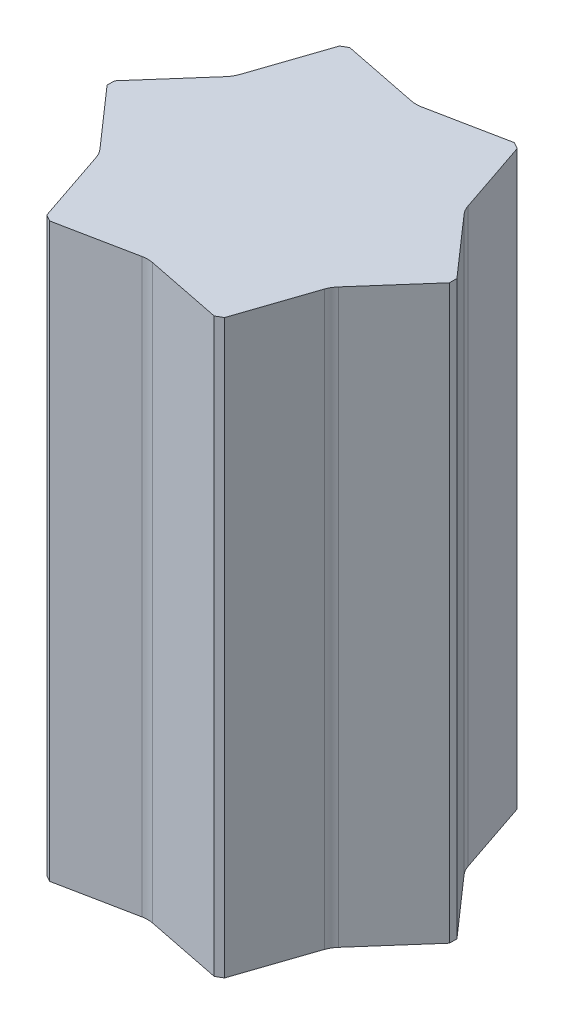
ISO-10303-21;
HEADER;
FILE_DESCRIPTION(('STEP AP214'),'2;1');
FILE_NAME('part.step','',(''),(''),'','','');
FILE_SCHEMA(('AUTOMOTIVE_DESIGN { 1 0 10303 214 1 1 1 1 }'));
ENDSEC;
DATA;
#1=APPLICATION_CONTEXT('core data for automotive mechanical design processes');
#2=APPLICATION_PROTOCOL_DEFINITION('international standard','automotive_design',2000,#1);
#3=PRODUCT_CONTEXT('',#1,'mechanical');
#4=PRODUCT('Part','Part','',(#3));
#5=PRODUCT_RELATED_PRODUCT_CATEGORY('part','',(#4));
#6=PRODUCT_DEFINITION_FORMATION('','',#4);
#7=PRODUCT_DEFINITION_CONTEXT('part definition',#1,'design');
#8=PRODUCT_DEFINITION('design','',#6,#7);
#9=PRODUCT_DEFINITION_SHAPE('','',#8);
#10=(LENGTH_UNIT() NAMED_UNIT(*) SI_UNIT(.MILLI.,.METRE.));
#11=(NAMED_UNIT(*) PLANE_ANGLE_UNIT() SI_UNIT($,.RADIAN.));
#12=(NAMED_UNIT(*) SI_UNIT($,.STERADIAN.) SOLID_ANGLE_UNIT());
#13=UNCERTAINTY_MEASURE_WITH_UNIT(LENGTH_MEASURE(1.E-05),#10,'distance_accuracy_value','');
#14=(GEOMETRIC_REPRESENTATION_CONTEXT(3) GLOBAL_UNCERTAINTY_ASSIGNED_CONTEXT((#13)) GLOBAL_UNIT_ASSIGNED_CONTEXT((#10,
#11,#12)) REPRESENTATION_CONTEXT('',''));
#15=CARTESIAN_POINT('',(0.,0.,0.));
#16=DIRECTION('',(0.,0.,1.));
#17=DIRECTION('',(1.,0.,0.));
#18=AXIS2_PLACEMENT_3D('',#15,#16,#17);
#19=CARTESIAN_POINT('',(395.,660.,8.66025403784437));
#20=DIRECTION('',(-1.,0.,0.));
#21=DIRECTION('',(0.,0.,1.));
#22=AXIS2_PLACEMENT_3D('',#19,#20,#21);
#23=PLANE('',#22);
#24=DIRECTION('',(0.,0.,-1.));
#25=VECTOR('',#24,1.);
#26=CARTESIAN_POINT('',(395.,-660.,8.66025403784437));
#27=LINE('',#26,#25);
#28=CARTESIAN_POINT('',(395.,-660.,8.66025403784604));
#29=VERTEX_POINT('',#28);
#30=CARTESIAN_POINT('',(395.000000000006,-660.,-8.66025403785374));
#31=VERTEX_POINT('',#30);
#32=EDGE_CURVE('E254',#29,#31,#27,.T.);
#33=ORIENTED_EDGE('',*,*,#32,.T.);
#34=DIRECTION('',(0.,-1.,0.));
#35=VECTOR('',#34,1.);
#36=CARTESIAN_POINT('',(395.,660.,-8.66025403784458));
#37=LINE('',#36,#35);
#38=CARTESIAN_POINT('',(395.000000000006,660.,-8.66025403785374));
#39=VERTEX_POINT('',#38);
#40=EDGE_CURVE('E11',#39,#31,#37,.T.);
#41=ORIENTED_EDGE('',*,*,#40,.F.);
#42=DIRECTION('',(0.,0.,-1.));
#43=VECTOR('',#42,1.);
#44=CARTESIAN_POINT('',(395.,660.,8.66025403784437));
#45=LINE('',#44,#43);
#46=CARTESIAN_POINT('',(395.,660.,8.66025403784604));
#47=VERTEX_POINT('',#46);
#48=EDGE_CURVE('E278',#47,#39,#45,.T.);
#49=ORIENTED_EDGE('',*,*,#48,.F.);
#50=DIRECTION('',(0.,-1.,0.));
#51=VECTOR('',#50,1.);
#52=CARTESIAN_POINT('',(395.,660.,8.66025403784437));
#53=LINE('',#52,#51);
#54=EDGE_CURVE('E253',#47,#29,#53,.T.);
#55=ORIENTED_EDGE('',*,*,#54,.T.);
#56=EDGE_LOOP('',(#33,#41,#49,#55));
#57=FACE_BOUND('',#56,.T.);
#58=ADVANCED_FACE('F45',(#57),#23,.F.);
#59=CARTESIAN_POINT('',(190.,660.,-346.410161513776));
#60=DIRECTION('',(-0.5,0.,0.866025403784439));
#61=DIRECTION('',(0.866025403784439,0.,0.5));
#62=AXIS2_PLACEMENT_3D('',#59,#60,#61);
#63=PLANE('',#62);
#64=DIRECTION('',(-0.866025403784439,0.,-0.5));
#65=VECTOR('',#64,1.);
#66=CARTESIAN_POINT('',(190.,-660.,-346.410161513776));
#67=LINE('',#66,#65);
#68=CARTESIAN_POINT('',(205.000000000011,-660.,-337.749907475932));
#69=VERTEX_POINT('',#68);
#70=CARTESIAN_POINT('',(190.,-660.,-346.410161513776));
#71=VERTEX_POINT('',#70);
#72=EDGE_CURVE('E258',#69,#71,#67,.T.);
#73=ORIENTED_EDGE('',*,*,#72,.T.);
#74=DIRECTION('',(0.,-1.,0.));
#75=VECTOR('',#74,1.);
#76=CARTESIAN_POINT('',(190.,660.,-346.410161513776));
#77=LINE('',#76,#75);
#78=CARTESIAN_POINT('',(190.,660.,-346.410161513776));
#79=VERTEX_POINT('',#78);
#80=EDGE_CURVE('E304',#79,#71,#77,.T.);
#81=ORIENTED_EDGE('',*,*,#80,.F.);
#82=DIRECTION('',(-0.866025403784439,0.,-0.5));
#83=VECTOR('',#82,1.);
#84=CARTESIAN_POINT('',(190.,660.,-346.410161513776));
#85=LINE('',#84,#83);
#86=CARTESIAN_POINT('',(205.000000000011,660.,-337.749907475932));
#87=VERTEX_POINT('',#86);
#88=EDGE_CURVE('E246',#87,#79,#85,.T.);
#89=ORIENTED_EDGE('',*,*,#88,.F.);
#90=DIRECTION('',(0.,-1.,0.));
#91=VECTOR('',#90,1.);
#92=CARTESIAN_POINT('',(205.,660.,-337.749907475931));
#93=LINE('',#92,#91);
#94=EDGE_CURVE('E53',#87,#69,#93,.T.);
#95=ORIENTED_EDGE('',*,*,#94,.T.);
#96=EDGE_LOOP('',(#73,#81,#89,#95));
#97=FACE_BOUND('',#96,.T.);
#98=ADVANCED_FACE('F313',(#97),#63,.F.);
#99=CARTESIAN_POINT('',(-190.,660.,-346.410161513775));
#100=DIRECTION('',(0.500000000000001,0.,0.866025403784438));
#101=DIRECTION('',(0.866025403784438,0.,-0.500000000000001));
#102=AXIS2_PLACEMENT_3D('',#99,#100,#101);
#103=PLANE('',#102);
#104=DIRECTION('',(-0.866025403784438,0.,0.500000000000002));
#105=VECTOR('',#104,1.);
#106=CARTESIAN_POINT('',(-190.,-660.,-346.410161513775));
#107=LINE('',#106,#105);
#108=CARTESIAN_POINT('',(-190.,-660.,-346.410161513775));
#109=VERTEX_POINT('',#108);
#110=CARTESIAN_POINT('',(-205.000000000005,-660.,-337.749907475928));
#111=VERTEX_POINT('',#110);
#112=EDGE_CURVE('E263',#109,#111,#107,.T.);
#113=ORIENTED_EDGE('',*,*,#112,.T.);
#114=DIRECTION('',(0.,-1.,0.));
#115=VECTOR('',#114,1.);
#116=CARTESIAN_POINT('',(-205.,660.,-337.749907475931));
#117=LINE('',#116,#115);
#118=CARTESIAN_POINT('',(-205.000000000005,660.,-337.749907475928));
#119=VERTEX_POINT('',#118);
#120=EDGE_CURVE('E218',#119,#111,#117,.T.);
#121=ORIENTED_EDGE('',*,*,#120,.F.);
#122=DIRECTION('',(-0.866025403784438,0.,0.500000000000002));
#123=VECTOR('',#122,1.);
#124=CARTESIAN_POINT('',(-190.,660.,-346.410161513775));
#125=LINE('',#124,#123);
#126=CARTESIAN_POINT('',(-190.,660.,-346.410161513775));
#127=VERTEX_POINT('',#126);
#128=EDGE_CURVE('E235',#127,#119,#125,.T.);
#129=ORIENTED_EDGE('',*,*,#128,.F.);
#130=DIRECTION('',(0.,-1.,0.));
#131=VECTOR('',#130,1.);
#132=CARTESIAN_POINT('',(-190.,660.,-346.410161513775));
#133=LINE('',#132,#131);
#134=EDGE_CURVE('E300',#127,#109,#133,.T.);
#135=ORIENTED_EDGE('',*,*,#134,.T.);
#136=EDGE_LOOP('',(#113,#121,#129,#135));
#137=FACE_BOUND('',#136,.T.);
#138=ADVANCED_FACE('F564',(#137),#103,.F.);
#139=CARTESIAN_POINT('',(-395.,660.,-8.66025403784456));
#140=DIRECTION('',(1.,0.,0.));
#141=DIRECTION('',(0.,0.,-1.));
#142=AXIS2_PLACEMENT_3D('',#139,#140,#141);
#143=PLANE('',#142);
#144=DIRECTION('',(0.,0.,1.));
#145=VECTOR('',#144,1.);
#146=CARTESIAN_POINT('',(-395.,-660.,-8.66025403784456));
#147=LINE('',#146,#145);
#148=CARTESIAN_POINT('',(-395.,-660.,-8.66025403784884));
#149=VERTEX_POINT('',#148);
#150=CARTESIAN_POINT('',(-394.999999999997,-660.,8.66025403785435));
#151=VERTEX_POINT('',#150);
#152=EDGE_CURVE('E267',#149,#151,#147,.T.);
#153=ORIENTED_EDGE('',*,*,#152,.T.);
#154=DIRECTION('',(0.,-1.,0.));
#155=VECTOR('',#154,1.);
#156=CARTESIAN_POINT('',(-395.,660.,8.66025403784465));
#157=LINE('',#156,#155);
#158=CARTESIAN_POINT('',(-394.999999999997,660.,8.66025403785435));
#159=VERTEX_POINT('',#158);
#160=EDGE_CURVE('E219',#159,#151,#157,.T.);
#161=ORIENTED_EDGE('',*,*,#160,.F.);
#162=DIRECTION('',(0.,0.,1.));
#163=VECTOR('',#162,1.);
#164=CARTESIAN_POINT('',(-395.,660.,-8.66025403784456));
#165=LINE('',#164,#163);
#166=CARTESIAN_POINT('',(-395.,660.,-8.66025403784884));
#167=VERTEX_POINT('',#166);
#168=EDGE_CURVE('E225',#167,#159,#165,.T.);
#169=ORIENTED_EDGE('',*,*,#168,.F.);
#170=DIRECTION('',(0.,-1.,0.));
#171=VECTOR('',#170,1.);
#172=CARTESIAN_POINT('',(-395.,660.,-8.66025403784456));
#173=LINE('',#172,#171);
#174=EDGE_CURVE('E205',#167,#149,#173,.T.);
#175=ORIENTED_EDGE('',*,*,#174,.T.);
#176=EDGE_LOOP('',(#153,#161,#169,#175));
#177=FACE_BOUND('',#176,.T.);
#178=ADVANCED_FACE('F232',(#177),#143,.F.);
#179=CARTESIAN_POINT('',(-190.,660.,346.410161513775));
#180=DIRECTION('',(0.500000000000006,0.,-0.866025403784435));
#181=DIRECTION('',(-0.866025403784435,0.,-0.500000000000006));
#182=AXIS2_PLACEMENT_3D('',#179,#180,#181);
#183=PLANE('',#182);
#184=DIRECTION('',(0.866025403784435,0.,0.500000000000006));
#185=VECTOR('',#184,1.);
#186=CARTESIAN_POINT('',(-190.,-660.,346.410161513775));
#187=LINE('',#186,#185);
#188=CARTESIAN_POINT('',(-205.000000000003,-660.,337.749907475929));
#189=VERTEX_POINT('',#188);
#190=CARTESIAN_POINT('',(-189.999999999988,-660.,346.410161513782));
#191=VERTEX_POINT('',#190);
#192=EDGE_CURVE('E270',#189,#191,#187,.T.);
#193=ORIENTED_EDGE('',*,*,#192,.T.);
#194=DIRECTION('',(0.,-1.,0.));
#195=VECTOR('',#194,1.);
#196=CARTESIAN_POINT('',(-190.,660.,346.410161513775));
#197=LINE('',#196,#195);
#198=CARTESIAN_POINT('',(-189.999999999988,660.,346.410161513782));
#199=VERTEX_POINT('',#198);
#200=EDGE_CURVE('E289',#199,#191,#197,.T.);
#201=ORIENTED_EDGE('',*,*,#200,.F.);
#202=DIRECTION('',(0.866025403784435,0.,0.500000000000006));
#203=VECTOR('',#202,1.);
#204=CARTESIAN_POINT('',(-190.,660.,346.410161513775));
#205=LINE('',#204,#203);
#206=CARTESIAN_POINT('',(-205.000000000003,660.,337.749907475929));
#207=VERTEX_POINT('',#206);
#208=EDGE_CURVE('E234',#207,#199,#205,.T.);
#209=ORIENTED_EDGE('',*,*,#208,.F.);
#210=DIRECTION('',(0.,-1.,0.));
#211=VECTOR('',#210,1.);
#212=CARTESIAN_POINT('',(-205.,660.,337.749907475931));
#213=LINE('',#212,#211);
#214=EDGE_CURVE('E292',#207,#189,#213,.T.);
#215=ORIENTED_EDGE('',*,*,#214,.T.);
#216=EDGE_LOOP('',(#193,#201,#209,#215));
#217=FACE_BOUND('',#216,.T.);
#218=ADVANCED_FACE('F512',(#217),#183,.F.);
#219=CARTESIAN_POINT('',(205.,660.,337.749907475931));
#220=DIRECTION('',(-0.500000000000002,0.,-0.866025403784437));
#221=DIRECTION('',(-0.866025403784437,0.,0.500000000000002));
#222=AXIS2_PLACEMENT_3D('',#219,#220,#221);
#223=PLANE('',#222);
#224=DIRECTION('',(0.866025403784437,0.,-0.500000000000002));
#225=VECTOR('',#224,1.);
#226=CARTESIAN_POINT('',(205.,-660.,337.749907475931));
#227=LINE('',#226,#225);
#228=CARTESIAN_POINT('',(189.999999999998,-660.,346.410161513777));
#229=VERTEX_POINT('',#228);
#230=CARTESIAN_POINT('',(205.000000000014,-660.,337.749907475928));
#231=VERTEX_POINT('',#230);
#232=EDGE_CURVE('E274',#229,#231,#227,.T.);
#233=ORIENTED_EDGE('',*,*,#232,.T.);
#234=DIRECTION('',(0.,-1.,0.));
#235=VECTOR('',#234,1.);
#236=CARTESIAN_POINT('',(205.,660.,337.749907475931));
#237=LINE('',#236,#235);
#238=CARTESIAN_POINT('',(205.000000000014,660.,337.749907475928));
#239=VERTEX_POINT('',#238);
#240=EDGE_CURVE('E282',#239,#231,#237,.T.);
#241=ORIENTED_EDGE('',*,*,#240,.F.);
#242=DIRECTION('',(0.866025403784437,0.,-0.500000000000002));
#243=VECTOR('',#242,1.);
#244=CARTESIAN_POINT('',(205.,660.,337.749907475931));
#245=LINE('',#244,#243);
#246=CARTESIAN_POINT('',(189.999999999998,660.,346.410161513777));
#247=VERTEX_POINT('',#246);
#248=EDGE_CURVE('E242',#247,#239,#245,.T.);
#249=ORIENTED_EDGE('',*,*,#248,.F.);
#250=DIRECTION('',(0.,-1.,0.));
#251=VECTOR('',#250,1.);
#252=CARTESIAN_POINT('',(190.,660.,346.410161513775));
#253=LINE('',#252,#251);
#254=EDGE_CURVE('E285',#247,#229,#253,.T.);
#255=ORIENTED_EDGE('',*,*,#254,.T.);
#256=EDGE_LOOP('',(#233,#241,#249,#255));
#257=FACE_BOUND('',#256,.T.);
#258=ADVANCED_FACE('F526',(#257),#223,.F.);
#259=CARTESIAN_POINT('',(0.,660.,0.));
#260=DIRECTION('',(0.,1.,0.));
#261=DIRECTION('',(0.,0.,1.));
#262=AXIS2_PLACEMENT_3D('',#259,#260,#261);
#263=PLANE('',#262);
#264=DIRECTION('',(-0.660042926924941,0.,-0.751227884610493));
#265=VECTOR('',#264,1.);
#266=CARTESIAN_POINT('',(-275.026938678269,660.,145.20759874899));
#267=LINE('',#266,#265);
#268=CARTESIAN_POINT('',(-275.026938678269,660.,145.20759874899));
#269=VERTEX_POINT('',#268);
#270=EDGE_CURVE('E436',#269,#159,#267,.T.);
#271=ORIENTED_EDGE('',*,*,#270,.F.);
#272=CARTESIAN_POINT('',(-320.100611754906,660.,184.810174364478));
#273=DIRECTION('',(0.,1.,0.));
#274=DIRECTION('',(0.,0.,1.));
#275=AXIS2_PLACEMENT_3D('',#272,#273,#274);
#276=CIRCLE('',#275,60.);
#277=CARTESIAN_POINT('',(-263.266938678284,660.,165.576516245972));
#278=VERTEX_POINT('',#277);
#279=EDGE_CURVE('E439',#278,#269,#276,.T.);
#280=ORIENTED_EDGE('',*,*,#279,.F.);
#281=DIRECTION('',(-0.320560968641442,0.,-0.947227884610488));
#282=VECTOR('',#281,1.);
#283=CARTESIAN_POINT('',(-205.000000000003,660.,337.749907475929));
#284=LINE('',#283,#282);
#285=EDGE_CURVE('E443',#207,#278,#284,.T.);
#286=ORIENTED_EDGE('',*,*,#285,.F.);
#287=ORIENTED_EDGE('',*,*,#208,.T.);
#288=DIRECTION('',(-0.980603895566403,0.,0.195999999999988));
#289=VECTOR('',#288,1.);
#290=CARTESIAN_POINT('',(-11.7599999999698,660.,310.784114994945));
#291=LINE('',#290,#289);
#292=CARTESIAN_POINT('',(-11.7599999999698,660.,310.784114994945));
#293=VERTEX_POINT('',#292);
#294=EDGE_CURVE('E462',#293,#199,#291,.T.);
#295=ORIENTED_EDGE('',*,*,#294,.F.);
#296=CARTESIAN_POINT('',(1.82956728387476E-11,660.,369.620348728931));
#297=DIRECTION('',(0.,1.,0.));
#298=DIRECTION('',(0.,0.,1.));
#299=AXIS2_PLACEMENT_3D('',#296,#297,#298);
#300=CIRCLE('',#299,60.0000000000016);
#301=CARTESIAN_POINT('',(11.7599999999976,660.,310.784114994942));
#302=VERTEX_POINT('',#301);
#303=EDGE_CURVE('E465',#302,#293,#300,.T.);
#304=ORIENTED_EDGE('',*,*,#303,.F.);
#305=DIRECTION('',(-0.980603895566399,0.,-0.196000000000007));
#306=VECTOR('',#305,1.);
#307=CARTESIAN_POINT('',(189.999999999998,660.,346.410161513777));
#308=LINE('',#307,#306);
#309=EDGE_CURVE('E426',#247,#302,#308,.T.);
#310=ORIENTED_EDGE('',*,*,#309,.F.);
#311=ORIENTED_EDGE('',*,*,#248,.T.);
#312=DIRECTION('',(-0.320560968641461,0.,0.947227884610482));
#313=VECTOR('',#312,1.);
#314=CARTESIAN_POINT('',(263.266938678304,660.,165.576516245955));
#315=LINE('',#314,#313);
#316=CARTESIAN_POINT('',(263.266938678304,660.,165.576516245955));
#317=VERTEX_POINT('',#316);
#318=EDGE_CURVE('E356',#317,#239,#315,.T.);
#319=ORIENTED_EDGE('',*,*,#318,.F.);
#320=CARTESIAN_POINT('',(320.100611754929,660.,184.810174364454));
#321=DIRECTION('',(0.,1.,0.));
#322=DIRECTION('',(0.,0.,1.));
#323=AXIS2_PLACEMENT_3D('',#320,#321,#322);
#324=CIRCLE('',#323,60.0000000000037);
#325=CARTESIAN_POINT('',(275.026938678284,660.,145.207598748969));
#326=VERTEX_POINT('',#325);
#327=EDGE_CURVE('E351',#326,#317,#324,.T.);
#328=ORIENTED_EDGE('',*,*,#327,.F.);
#329=DIRECTION('',(-0.660042926924953,0.,0.751227884610483));
#330=VECTOR('',#329,1.);
#331=CARTESIAN_POINT('',(395.,660.,8.66025403784604));
#332=LINE('',#331,#330);
#333=EDGE_CURVE('E347',#47,#326,#332,.T.);
#334=ORIENTED_EDGE('',*,*,#333,.F.);
#335=ORIENTED_EDGE('',*,*,#48,.T.);
#336=DIRECTION('',(0.660042926924941,0.,0.751227884610493));
#337=VECTOR('',#336,1.);
#338=CARTESIAN_POINT('',(275.026938678278,660.,-145.20759874899));
#339=LINE('',#338,#337);
#340=CARTESIAN_POINT('',(275.026938678278,660.,-145.20759874899));
#341=VERTEX_POINT('',#340);
#342=EDGE_CURVE('E382',#341,#39,#339,.T.);
#343=ORIENTED_EDGE('',*,*,#342,.F.);
#344=CARTESIAN_POINT('',(320.100611754915,660.,-184.810174364478));
#345=DIRECTION('',(0.,1.,0.));
#346=DIRECTION('',(0.,0.,1.));
#347=AXIS2_PLACEMENT_3D('',#344,#345,#346);
#348=CIRCLE('',#347,60.0000000000042);
#349=CARTESIAN_POINT('',(263.266938678286,660.,-165.576516245976));
#350=VERTEX_POINT('',#349);
#351=EDGE_CURVE('E378',#350,#341,#348,.T.);
#352=ORIENTED_EDGE('',*,*,#351,.F.);
#353=DIRECTION('',(0.320560968641396,0.,0.947227884610504));
#354=VECTOR('',#353,1.);
#355=CARTESIAN_POINT('',(205.000000000011,660.,-337.749907475932));
#356=LINE('',#355,#354);
#357=EDGE_CURVE('E345',#87,#350,#356,.T.);
#358=ORIENTED_EDGE('',*,*,#357,.F.);
#359=ORIENTED_EDGE('',*,*,#88,.T.);
#360=DIRECTION('',(0.98060389556641,0.,-0.195999999999953));
#361=VECTOR('',#360,1.);
#362=CARTESIAN_POINT('',(11.7599999999785,660.,-310.784114994945));
#363=LINE('',#362,#361);
#364=CARTESIAN_POINT('',(11.7599999999785,660.,-310.784114994945));
#365=VERTEX_POINT('',#364);
#366=EDGE_CURVE('E404',#365,#79,#363,.T.);
#367=ORIENTED_EDGE('',*,*,#366,.F.);
#368=CARTESIAN_POINT('',(-9.54903444555092E-12,660.,-369.620348728931));
#369=DIRECTION('',(0.,1.,0.));
#370=DIRECTION('',(0.,0.,1.));
#371=AXIS2_PLACEMENT_3D('',#368,#369,#370);
#372=CIRCLE('',#371,60.0000000000026);
#373=CARTESIAN_POINT('',(-11.7599999999996,660.,-310.784114994942));
#374=VERTEX_POINT('',#373);
#375=EDGE_CURVE('E409',#374,#365,#372,.T.);
#376=ORIENTED_EDGE('',*,*,#375,.F.);
#377=DIRECTION('',(0.980603895566401,0.,0.196));
#378=VECTOR('',#377,1.);
#379=CARTESIAN_POINT('',(-190.,660.,-346.410161513775));
#380=LINE('',#379,#378);
#381=EDGE_CURVE('E374',#127,#374,#380,.T.);
#382=ORIENTED_EDGE('',*,*,#381,.F.);
#383=ORIENTED_EDGE('',*,*,#128,.T.);
#384=DIRECTION('',(0.320560968641461,0.,-0.947227884610482));
#385=VECTOR('',#384,1.);
#386=CARTESIAN_POINT('',(-263.266938678295,660.,-165.576516245955));
#387=LINE('',#386,#385);
#388=CARTESIAN_POINT('',(-263.266938678295,660.,-165.576516245955));
#389=VERTEX_POINT('',#388);
#390=EDGE_CURVE('E487',#389,#119,#387,.T.);
#391=ORIENTED_EDGE('',*,*,#390,.F.);
#392=CARTESIAN_POINT('',(-320.10061175492,660.,-184.810174364453));
#393=DIRECTION('',(0.,1.,0.));
#394=DIRECTION('',(0.,0.,1.));
#395=AXIS2_PLACEMENT_3D('',#392,#393,#394);
#396=CIRCLE('',#395,60.0000000000001);
#397=CARTESIAN_POINT('',(-275.026938678281,660.,-145.207598748968));
#398=VERTEX_POINT('',#397);
#399=EDGE_CURVE('E229',#398,#389,#396,.T.);
#400=ORIENTED_EDGE('',*,*,#399,.F.);
#401=DIRECTION('',(0.660042926924959,0.,-0.751227884610478));
#402=VECTOR('',#401,1.);
#403=CARTESIAN_POINT('',(-395.,660.,-8.66025403784884));
#404=LINE('',#403,#402);
#405=EDGE_CURVE('E209',#167,#398,#404,.T.);
#406=ORIENTED_EDGE('',*,*,#405,.F.);
#407=ORIENTED_EDGE('',*,*,#168,.T.);
#408=EDGE_LOOP('',(#271,#280,#286,#287,#295,#304,#310,#311,#319,#328,#334,#335,#343,#352,#358,
#359,#367,#376,#382,#383,#391,#400,#406,#407));
#409=FACE_BOUND('',#408,.T.);
#410=ADVANCED_FACE('F224',(#409),#263,.T.);
#411=CARTESIAN_POINT('',(0.,-660.,0.));
#412=DIRECTION('',(0.,1.,0.));
#413=DIRECTION('',(0.,0.,1.));
#414=AXIS2_PLACEMENT_3D('',#411,#412,#413);
#415=PLANE('',#414);
#416=CARTESIAN_POINT('',(-320.100611754906,-660.,184.810174364478));
#417=DIRECTION('',(0.,1.,0.));
#418=DIRECTION('',(0.,0.,1.));
#419=AXIS2_PLACEMENT_3D('',#416,#417,#418);
#420=CIRCLE('',#419,60.);
#421=CARTESIAN_POINT('',(-263.266938678284,-660.,165.576516245972));
#422=VERTEX_POINT('',#421);
#423=CARTESIAN_POINT('',(-275.026938678269,-660.,145.20759874899));
#424=VERTEX_POINT('',#423);
#425=EDGE_CURVE('E60',#422,#424,#420,.T.);
#426=ORIENTED_EDGE('',*,*,#425,.T.);
#427=DIRECTION('',(-0.660042926924941,0.,-0.751227884610493));
#428=VECTOR('',#427,1.);
#429=CARTESIAN_POINT('',(-275.026938678269,-660.,145.20759874899));
#430=LINE('',#429,#428);
#431=EDGE_CURVE('E423',#424,#151,#430,.T.);
#432=ORIENTED_EDGE('',*,*,#431,.T.);
#433=ORIENTED_EDGE('',*,*,#152,.F.);
#434=DIRECTION('',(0.660042926924959,0.,-0.751227884610478));
#435=VECTOR('',#434,1.);
#436=CARTESIAN_POINT('',(-395.,-660.,-8.66025403784884));
#437=LINE('',#436,#435);
#438=CARTESIAN_POINT('',(-275.026938678281,-660.,-145.207598748968));
#439=VERTEX_POINT('',#438);
#440=EDGE_CURVE('E212',#149,#439,#437,.T.);
#441=ORIENTED_EDGE('',*,*,#440,.T.);
#442=CARTESIAN_POINT('',(-320.10061175492,-660.,-184.810174364453));
#443=DIRECTION('',(0.,1.,0.));
#444=DIRECTION('',(0.,0.,1.));
#445=AXIS2_PLACEMENT_3D('',#442,#443,#444);
#446=CIRCLE('',#445,60.0000000000001);
#447=CARTESIAN_POINT('',(-263.266938678295,-660.,-165.576516245955));
#448=VERTEX_POINT('',#447);
#449=EDGE_CURVE('E481',#439,#448,#446,.T.);
#450=ORIENTED_EDGE('',*,*,#449,.T.);
#451=DIRECTION('',(0.320560968641461,0.,-0.947227884610482));
#452=VECTOR('',#451,1.);
#453=CARTESIAN_POINT('',(-263.266938678295,-660.,-165.576516245955));
#454=LINE('',#453,#452);
#455=EDGE_CURVE('E475',#448,#111,#454,.T.);
#456=ORIENTED_EDGE('',*,*,#455,.T.);
#457=ORIENTED_EDGE('',*,*,#112,.F.);
#458=DIRECTION('',(0.980603895566401,0.,0.196));
#459=VECTOR('',#458,1.);
#460=CARTESIAN_POINT('',(-190.,-660.,-346.410161513775));
#461=LINE('',#460,#459);
#462=CARTESIAN_POINT('',(-11.7599999999995,-660.,-310.78411499494));
#463=VERTEX_POINT('',#462);
#464=EDGE_CURVE('E340',#109,#463,#461,.T.);
#465=ORIENTED_EDGE('',*,*,#464,.T.);
#466=CARTESIAN_POINT('',(-9.54903444555092E-12,-660.,-369.620348728931));
#467=DIRECTION('',(0.,1.,0.));
#468=DIRECTION('',(0.,0.,1.));
#469=AXIS2_PLACEMENT_3D('',#466,#467,#468);
#470=CIRCLE('',#469,60.0000000000026);
#471=CARTESIAN_POINT('',(11.7599999999785,-660.,-310.784114994945));
#472=VERTEX_POINT('',#471);
#473=EDGE_CURVE('E329',#463,#472,#470,.T.);
#474=ORIENTED_EDGE('',*,*,#473,.T.);
#475=DIRECTION('',(0.98060389556641,0.,-0.195999999999953));
#476=VECTOR('',#475,1.);
#477=CARTESIAN_POINT('',(11.7599999999785,-660.,-310.784114994945));
#478=LINE('',#477,#476);
#479=EDGE_CURVE('E327',#472,#71,#478,.T.);
#480=ORIENTED_EDGE('',*,*,#479,.T.);
#481=ORIENTED_EDGE('',*,*,#72,.F.);
#482=DIRECTION('',(0.320560968641396,0.,0.947227884610504));
#483=VECTOR('',#482,1.);
#484=CARTESIAN_POINT('',(205.000000000011,-660.,-337.749907475932));
#485=LINE('',#484,#483);
#486=CARTESIAN_POINT('',(263.266938678282,-660.,-165.576516245976));
#487=VERTEX_POINT('',#486);
#488=EDGE_CURVE('E324',#69,#487,#485,.T.);
#489=ORIENTED_EDGE('',*,*,#488,.T.);
#490=CARTESIAN_POINT('',(320.100611754915,-660.,-184.810174364478));
#491=DIRECTION('',(0.,1.,0.));
#492=DIRECTION('',(0.,0.,1.));
#493=AXIS2_PLACEMENT_3D('',#490,#491,#492);
#494=CIRCLE('',#493,60.0000000000042);
#495=CARTESIAN_POINT('',(275.026938678278,-660.,-145.20759874899));
#496=VERTEX_POINT('',#495);
#497=EDGE_CURVE('E387',#487,#496,#494,.T.);
#498=ORIENTED_EDGE('',*,*,#497,.T.);
#499=DIRECTION('',(0.660042926924941,0.,0.751227884610493));
#500=VECTOR('',#499,1.);
#501=CARTESIAN_POINT('',(275.026938678278,-660.,-145.20759874899));
#502=LINE('',#501,#500);
#503=EDGE_CURVE('E389',#496,#31,#502,.T.);
#504=ORIENTED_EDGE('',*,*,#503,.T.);
#505=ORIENTED_EDGE('',*,*,#32,.F.);
#506=DIRECTION('',(-0.660042926924953,0.,0.751227884610483));
#507=VECTOR('',#506,1.);
#508=CARTESIAN_POINT('',(395.,-660.,8.66025403784604));
#509=LINE('',#508,#507);
#510=CARTESIAN_POINT('',(275.02693867828,-660.,145.207598748969));
#511=VERTEX_POINT('',#510);
#512=EDGE_CURVE('E358',#29,#511,#509,.T.);
#513=ORIENTED_EDGE('',*,*,#512,.T.);
#514=CARTESIAN_POINT('',(320.100611754929,-660.,184.810174364454));
#515=DIRECTION('',(0.,1.,0.));
#516=DIRECTION('',(0.,0.,1.));
#517=AXIS2_PLACEMENT_3D('',#514,#515,#516);
#518=CIRCLE('',#517,60.0000000000037);
#519=CARTESIAN_POINT('',(263.266938678304,-660.,165.576516245955));
#520=VERTEX_POINT('',#519);
#521=EDGE_CURVE('E362',#511,#520,#518,.T.);
#522=ORIENTED_EDGE('',*,*,#521,.T.);
#523=DIRECTION('',(-0.320560968641461,0.,0.947227884610482));
#524=VECTOR('',#523,1.);
#525=CARTESIAN_POINT('',(263.266938678304,-660.,165.576516245955));
#526=LINE('',#525,#524);
#527=EDGE_CURVE('E366',#520,#231,#526,.T.);
#528=ORIENTED_EDGE('',*,*,#527,.T.);
#529=ORIENTED_EDGE('',*,*,#232,.F.);
#530=DIRECTION('',(-0.980603895566399,0.,-0.196000000000007));
#531=VECTOR('',#530,1.);
#532=CARTESIAN_POINT('',(189.999999999998,-660.,346.410161513777));
#533=LINE('',#532,#531);
#534=CARTESIAN_POINT('',(11.7599999999976,-660.,310.78411499494));
#535=VERTEX_POINT('',#534);
#536=EDGE_CURVE('E458',#229,#535,#533,.T.);
#537=ORIENTED_EDGE('',*,*,#536,.T.);
#538=CARTESIAN_POINT('',(1.82956728387476E-11,-660.,369.620348728931));
#539=DIRECTION('',(0.,1.,0.));
#540=DIRECTION('',(0.,0.,1.));
#541=AXIS2_PLACEMENT_3D('',#538,#539,#540);
#542=CIRCLE('',#541,60.0000000000016);
#543=CARTESIAN_POINT('',(-11.7599999999698,-660.,310.784114994945));
#544=VERTEX_POINT('',#543);
#545=EDGE_CURVE('E68',#535,#544,#542,.T.);
#546=ORIENTED_EDGE('',*,*,#545,.T.);
#547=DIRECTION('',(-0.980603895566403,0.,0.195999999999988));
#548=VECTOR('',#547,1.);
#549=CARTESIAN_POINT('',(-11.7599999999698,-660.,310.784114994945));
#550=LINE('',#549,#548);
#551=EDGE_CURVE('E451',#544,#191,#550,.T.);
#552=ORIENTED_EDGE('',*,*,#551,.T.);
#553=ORIENTED_EDGE('',*,*,#192,.F.);
#554=DIRECTION('',(-0.320560968641442,0.,-0.947227884610488));
#555=VECTOR('',#554,1.);
#556=CARTESIAN_POINT('',(-205.000000000003,-660.,337.749907475929));
#557=LINE('',#556,#555);
#558=EDGE_CURVE('E432',#189,#422,#557,.T.);
#559=ORIENTED_EDGE('',*,*,#558,.T.);
#560=EDGE_LOOP('',(#426,#432,#433,#441,#450,#456,#457,#465,#474,#480,#481,#489,#498,#504,#505,
#513,#522,#528,#529,#537,#546,#552,#553,#559));
#561=FACE_BOUND('',#560,.T.);
#562=ADVANCED_FACE('F322',(#561),#415,.F.);
#563=CARTESIAN_POINT('',(275.026938678278,-660.,-145.20759874899));
#564=DIRECTION('',(-0.751227884610493,0.,0.660042926924941));
#565=DIRECTION('',(0.660042926924941,0.,0.751227884610493));
#566=AXIS2_PLACEMENT_3D('',#563,#564,#565);
#567=PLANE('',#566);
#568=ORIENTED_EDGE('',*,*,#40,.T.);
#569=ORIENTED_EDGE('',*,*,#503,.F.);
#570=DIRECTION('',(0.,1.,0.));
#571=VECTOR('',#570,1.);
#572=CARTESIAN_POINT('',(275.026938678278,-660.,-145.20759874899));
#573=LINE('',#572,#571);
#574=EDGE_CURVE('E259',#496,#341,#573,.T.);
#575=ORIENTED_EDGE('',*,*,#574,.T.);
#576=ORIENTED_EDGE('',*,*,#342,.T.);
#577=EDGE_LOOP('',(#568,#569,#575,#576));
#578=FACE_BOUND('',#577,.T.);
#579=ADVANCED_FACE('F545',(#578),#567,.F.);
#580=CARTESIAN_POINT('',(320.100611754915,-660.,-184.810174364478));
#581=DIRECTION('',(0.,1.,0.));
#582=DIRECTION('',(0.,0.,1.));
#583=AXIS2_PLACEMENT_3D('',#580,#581,#582);
#584=CYLINDRICAL_SURFACE('',#583,60.0000000000042);
#585=ORIENTED_EDGE('',*,*,#574,.F.);
#586=ORIENTED_EDGE('',*,*,#497,.F.);
#587=DIRECTION('',(0.,1.,0.));
#588=VECTOR('',#587,1.);
#589=CARTESIAN_POINT('',(263.266938678286,-660.,-165.576516245976));
#590=LINE('',#589,#588);
#591=EDGE_CURVE('E393',#487,#350,#590,.T.);
#592=ORIENTED_EDGE('',*,*,#591,.T.);
#593=ORIENTED_EDGE('',*,*,#351,.T.);
#594=EDGE_LOOP('',(#585,#586,#592,#593));
#595=FACE_BOUND('',#594,.T.);
#596=ADVANCED_FACE('F548',(#595),#584,.F.);
#597=CARTESIAN_POINT('',(205.000000000011,-660.,-337.749907475932));
#598=DIRECTION('',(-0.947227884610504,0.,0.320560968641396));
#599=DIRECTION('',(0.320560968641396,0.,0.947227884610504));
#600=AXIS2_PLACEMENT_3D('',#597,#598,#599);
#601=PLANE('',#600);
#602=ORIENTED_EDGE('',*,*,#591,.F.);
#603=ORIENTED_EDGE('',*,*,#488,.F.);
#604=ORIENTED_EDGE('',*,*,#94,.F.);
#605=ORIENTED_EDGE('',*,*,#357,.T.);
#606=EDGE_LOOP('',(#602,#603,#604,#605));
#607=FACE_BOUND('',#606,.T.);
#608=ADVANCED_FACE('F550',(#607),#601,.F.);
#609=CARTESIAN_POINT('',(-263.266938678295,-660.,-165.576516245955));
#610=DIRECTION('',(0.947227884610482,0.,0.320560968641461));
#611=DIRECTION('',(0.320560968641461,0.,-0.947227884610482));
#612=AXIS2_PLACEMENT_3D('',#609,#610,#611);
#613=PLANE('',#612);
#614=ORIENTED_EDGE('',*,*,#120,.T.);
#615=ORIENTED_EDGE('',*,*,#455,.F.);
#616=DIRECTION('',(0.,1.,0.));
#617=VECTOR('',#616,1.);
#618=CARTESIAN_POINT('',(-263.266938678295,-660.,-165.576516245955));
#619=LINE('',#618,#617);
#620=EDGE_CURVE('E447',#448,#389,#619,.T.);
#621=ORIENTED_EDGE('',*,*,#620,.T.);
#622=ORIENTED_EDGE('',*,*,#390,.T.);
#623=EDGE_LOOP('',(#614,#615,#621,#622));
#624=FACE_BOUND('',#623,.T.);
#625=ADVANCED_FACE('F499',(#624),#613,.F.);
#626=CARTESIAN_POINT('',(-320.10061175492,-660.,-184.810174364453));
#627=DIRECTION('',(0.,1.,0.));
#628=DIRECTION('',(0.,0.,1.));
#629=AXIS2_PLACEMENT_3D('',#626,#627,#628);
#630=CYLINDRICAL_SURFACE('',#629,60.0000000000001);
#631=ORIENTED_EDGE('',*,*,#620,.F.);
#632=ORIENTED_EDGE('',*,*,#449,.F.);
#633=DIRECTION('',(0.,1.,0.));
#634=VECTOR('',#633,1.);
#635=CARTESIAN_POINT('',(-275.026938678281,-660.,-145.207598748968));
#636=LINE('',#635,#634);
#637=EDGE_CURVE('E472',#439,#398,#636,.T.);
#638=ORIENTED_EDGE('',*,*,#637,.T.);
#639=ORIENTED_EDGE('',*,*,#399,.T.);
#640=EDGE_LOOP('',(#631,#632,#638,#639));
#641=FACE_BOUND('',#640,.T.);
#642=ADVANCED_FACE('F493',(#641),#630,.F.);
#643=CARTESIAN_POINT('',(-395.,-660.,-8.66025403784884));
#644=DIRECTION('',(0.751227884610478,0.,0.660042926924959));
#645=DIRECTION('',(0.660042926924959,0.,-0.751227884610478));
#646=AXIS2_PLACEMENT_3D('',#643,#644,#645);
#647=PLANE('',#646);
#648=ORIENTED_EDGE('',*,*,#637,.F.);
#649=ORIENTED_EDGE('',*,*,#440,.F.);
#650=ORIENTED_EDGE('',*,*,#174,.F.);
#651=ORIENTED_EDGE('',*,*,#405,.T.);
#652=EDGE_LOOP('',(#648,#649,#650,#651));
#653=FACE_BOUND('',#652,.T.);
#654=ADVANCED_FACE('F208',(#653),#647,.F.);
#655=CARTESIAN_POINT('',(11.7599999999785,-660.,-310.784114994945));
#656=DIRECTION('',(0.195999999999953,0.,0.98060389556641));
#657=DIRECTION('',(0.98060389556641,0.,-0.195999999999953));
#658=AXIS2_PLACEMENT_3D('',#655,#656,#657);
#659=PLANE('',#658);
#660=ORIENTED_EDGE('',*,*,#80,.T.);
#661=ORIENTED_EDGE('',*,*,#479,.F.);
#662=DIRECTION('',(0.,1.,0.));
#663=VECTOR('',#662,1.);
#664=CARTESIAN_POINT('',(11.7599999999785,-660.,-310.784114994945));
#665=LINE('',#664,#663);
#666=EDGE_CURVE('E337',#472,#365,#665,.T.);
#667=ORIENTED_EDGE('',*,*,#666,.T.);
#668=ORIENTED_EDGE('',*,*,#366,.T.);
#669=EDGE_LOOP('',(#660,#661,#667,#668));
#670=FACE_BOUND('',#669,.T.);
#671=ADVANCED_FACE('F406',(#670),#659,.F.);
#672=CARTESIAN_POINT('',(-9.54903444555092E-12,-660.,-369.620348728931));
#673=DIRECTION('',(0.,1.,0.));
#674=DIRECTION('',(0.,0.,1.));
#675=AXIS2_PLACEMENT_3D('',#672,#673,#674);
#676=CYLINDRICAL_SURFACE('',#675,60.0000000000026);
#677=ORIENTED_EDGE('',*,*,#666,.F.);
#678=ORIENTED_EDGE('',*,*,#473,.F.);
#679=DIRECTION('',(0.,1.,0.));
#680=VECTOR('',#679,1.);
#681=CARTESIAN_POINT('',(-11.7599999999996,-660.,-310.784114994942));
#682=LINE('',#681,#680);
#683=EDGE_CURVE('E332',#463,#374,#682,.T.);
#684=ORIENTED_EDGE('',*,*,#683,.T.);
#685=ORIENTED_EDGE('',*,*,#375,.T.);
#686=EDGE_LOOP('',(#677,#678,#684,#685));
#687=FACE_BOUND('',#686,.T.);
#688=ADVANCED_FACE('F623',(#687),#676,.F.);
#689=CARTESIAN_POINT('',(-190.,-660.,-346.410161513775));
#690=DIRECTION('',(-0.196,0.,0.980603895566401));
#691=DIRECTION('',(0.980603895566401,0.,0.196));
#692=AXIS2_PLACEMENT_3D('',#689,#690,#691);
#693=PLANE('',#692);
#694=ORIENTED_EDGE('',*,*,#683,.F.);
#695=ORIENTED_EDGE('',*,*,#464,.F.);
#696=ORIENTED_EDGE('',*,*,#134,.F.);
#697=ORIENTED_EDGE('',*,*,#381,.T.);
#698=EDGE_LOOP('',(#694,#695,#696,#697));
#699=FACE_BOUND('',#698,.T.);
#700=ADVANCED_FACE('F631',(#699),#693,.F.);
#701=CARTESIAN_POINT('',(263.266938678304,-660.,165.576516245955));
#702=DIRECTION('',(-0.947227884610482,0.,-0.320560968641461));
#703=DIRECTION('',(-0.320560968641461,0.,0.947227884610482));
#704=AXIS2_PLACEMENT_3D('',#701,#702,#703);
#705=PLANE('',#704);
#706=ORIENTED_EDGE('',*,*,#240,.T.);
#707=ORIENTED_EDGE('',*,*,#527,.F.);
#708=DIRECTION('',(0.,1.,0.));
#709=VECTOR('',#708,1.);
#710=CARTESIAN_POINT('',(263.266938678304,-660.,165.576516245955));
#711=LINE('',#710,#709);
#712=EDGE_CURVE('E371',#520,#317,#711,.T.);
#713=ORIENTED_EDGE('',*,*,#712,.T.);
#714=ORIENTED_EDGE('',*,*,#318,.T.);
#715=EDGE_LOOP('',(#706,#707,#713,#714));
#716=FACE_BOUND('',#715,.T.);
#717=ADVANCED_FACE('F530',(#716),#705,.F.);
#718=CARTESIAN_POINT('',(320.100611754929,-660.,184.810174364454));
#719=DIRECTION('',(0.,1.,0.));
#720=DIRECTION('',(0.,0.,1.));
#721=AXIS2_PLACEMENT_3D('',#718,#719,#720);
#722=CYLINDRICAL_SURFACE('',#721,60.0000000000037);
#723=ORIENTED_EDGE('',*,*,#712,.F.);
#724=ORIENTED_EDGE('',*,*,#521,.F.);
#725=DIRECTION('',(0.,1.,0.));
#726=VECTOR('',#725,1.);
#727=CARTESIAN_POINT('',(275.026938678284,-660.,145.207598748969));
#728=LINE('',#727,#726);
#729=EDGE_CURVE('E370',#511,#326,#728,.T.);
#730=ORIENTED_EDGE('',*,*,#729,.T.);
#731=ORIENTED_EDGE('',*,*,#327,.T.);
#732=EDGE_LOOP('',(#723,#724,#730,#731));
#733=FACE_BOUND('',#732,.T.);
#734=ADVANCED_FACE('F536',(#733),#722,.F.);
#735=CARTESIAN_POINT('',(395.,-660.,8.66025403784604));
#736=DIRECTION('',(-0.751227884610483,0.,-0.660042926924953));
#737=DIRECTION('',(-0.660042926924953,0.,0.751227884610483));
#738=AXIS2_PLACEMENT_3D('',#735,#736,#737);
#739=PLANE('',#738);
#740=ORIENTED_EDGE('',*,*,#729,.F.);
#741=ORIENTED_EDGE('',*,*,#512,.F.);
#742=ORIENTED_EDGE('',*,*,#54,.F.);
#743=ORIENTED_EDGE('',*,*,#333,.T.);
#744=EDGE_LOOP('',(#740,#741,#742,#743));
#745=FACE_BOUND('',#744,.T.);
#746=ADVANCED_FACE('F539',(#745),#739,.F.);
#747=CARTESIAN_POINT('',(-11.7599999999698,-660.,310.784114994945));
#748=DIRECTION('',(-0.195999999999988,0.,-0.980603895566403));
#749=DIRECTION('',(-0.980603895566403,0.,0.195999999999988));
#750=AXIS2_PLACEMENT_3D('',#747,#748,#749);
#751=PLANE('',#750);
#752=ORIENTED_EDGE('',*,*,#200,.T.);
#753=ORIENTED_EDGE('',*,*,#551,.F.);
#754=DIRECTION('',(0.,1.,0.));
#755=VECTOR('',#754,1.);
#756=CARTESIAN_POINT('',(-11.7599999999698,-660.,310.784114994945));
#757=LINE('',#756,#755);
#758=EDGE_CURVE('E352',#544,#293,#757,.T.);
#759=ORIENTED_EDGE('',*,*,#758,.T.);
#760=ORIENTED_EDGE('',*,*,#294,.T.);
#761=EDGE_LOOP('',(#752,#753,#759,#760));
#762=FACE_BOUND('',#761,.T.);
#763=ADVANCED_FACE('F516',(#762),#751,.F.);
#764=CARTESIAN_POINT('',(1.82956728387476E-11,-660.,369.620348728931));
#765=DIRECTION('',(0.,1.,0.));
#766=DIRECTION('',(0.,0.,1.));
#767=AXIS2_PLACEMENT_3D('',#764,#765,#766);
#768=CYLINDRICAL_SURFACE('',#767,60.0000000000016);
#769=ORIENTED_EDGE('',*,*,#758,.F.);
#770=ORIENTED_EDGE('',*,*,#545,.F.);
#771=DIRECTION('',(0.,1.,0.));
#772=VECTOR('',#771,1.);
#773=CARTESIAN_POINT('',(11.7599999999976,-660.,310.784114994942));
#774=LINE('',#773,#772);
#775=EDGE_CURVE('E448',#535,#302,#774,.T.);
#776=ORIENTED_EDGE('',*,*,#775,.T.);
#777=ORIENTED_EDGE('',*,*,#303,.T.);
#778=EDGE_LOOP('',(#769,#770,#776,#777));
#779=FACE_BOUND('',#778,.T.);
#780=ADVANCED_FACE('F521',(#779),#768,.F.);
#781=CARTESIAN_POINT('',(189.999999999998,-660.,346.410161513777));
#782=DIRECTION('',(0.196000000000007,0.,-0.980603895566399));
#783=DIRECTION('',(-0.980603895566399,0.,-0.196000000000007));
#784=AXIS2_PLACEMENT_3D('',#781,#782,#783);
#785=PLANE('',#784);
#786=ORIENTED_EDGE('',*,*,#775,.F.);
#787=ORIENTED_EDGE('',*,*,#536,.F.);
#788=ORIENTED_EDGE('',*,*,#254,.F.);
#789=ORIENTED_EDGE('',*,*,#309,.T.);
#790=EDGE_LOOP('',(#786,#787,#788,#789));
#791=FACE_BOUND('',#790,.T.);
#792=ADVANCED_FACE('F523',(#791),#785,.F.);
#793=CARTESIAN_POINT('',(-275.026938678269,-660.,145.20759874899));
#794=DIRECTION('',(0.751227884610493,0.,-0.660042926924941));
#795=DIRECTION('',(-0.660042926924941,0.,-0.751227884610494));
#796=AXIS2_PLACEMENT_3D('',#793,#794,#795);
#797=PLANE('',#796);
#798=ORIENTED_EDGE('',*,*,#160,.T.);
#799=ORIENTED_EDGE('',*,*,#431,.F.);
#800=DIRECTION('',(0.,1.,0.));
#801=VECTOR('',#800,1.);
#802=CARTESIAN_POINT('',(-275.026938678269,-660.,145.20759874899));
#803=LINE('',#802,#801);
#804=EDGE_CURVE('E422',#424,#269,#803,.T.);
#805=ORIENTED_EDGE('',*,*,#804,.T.);
#806=ORIENTED_EDGE('',*,*,#270,.T.);
#807=EDGE_LOOP('',(#798,#799,#805,#806));
#808=FACE_BOUND('',#807,.T.);
#809=ADVANCED_FACE('F503',(#808),#797,.F.);
#810=CARTESIAN_POINT('',(-320.100611754906,-660.,184.810174364478));
#811=DIRECTION('',(0.,1.,0.));
#812=DIRECTION('',(0.,0.,1.));
#813=AXIS2_PLACEMENT_3D('',#810,#811,#812);
#814=CYLINDRICAL_SURFACE('',#813,60.);
#815=ORIENTED_EDGE('',*,*,#804,.F.);
#816=ORIENTED_EDGE('',*,*,#425,.F.);
#817=DIRECTION('',(0.,1.,0.));
#818=VECTOR('',#817,1.);
#819=CARTESIAN_POINT('',(-263.266938678284,-660.,165.576516245972));
#820=LINE('',#819,#818);
#821=EDGE_CURVE('E419',#422,#278,#820,.T.);
#822=ORIENTED_EDGE('',*,*,#821,.T.);
#823=ORIENTED_EDGE('',*,*,#279,.T.);
#824=EDGE_LOOP('',(#815,#816,#822,#823));
#825=FACE_BOUND('',#824,.T.);
#826=ADVANCED_FACE('F507',(#825),#814,.F.);
#827=CARTESIAN_POINT('',(-205.000000000003,-660.,337.749907475929));
#828=DIRECTION('',(0.947227884610488,0.,-0.320560968641442));
#829=DIRECTION('',(-0.320560968641442,0.,-0.947227884610488));
#830=AXIS2_PLACEMENT_3D('',#827,#828,#829);
#831=PLANE('',#830);
#832=ORIENTED_EDGE('',*,*,#821,.F.);
#833=ORIENTED_EDGE('',*,*,#558,.F.);
#834=ORIENTED_EDGE('',*,*,#214,.F.);
#835=ORIENTED_EDGE('',*,*,#285,.T.);
#836=EDGE_LOOP('',(#832,#833,#834,#835));
#837=FACE_BOUND('',#836,.T.);
#838=ADVANCED_FACE('F509',(#837),#831,.F.);
#839=CLOSED_SHELL('',(#58,#98,#138,#178,#218,#258,#410,#562,#579,#596,#608,#625,#642,#654,#671,
#688,#700,#717,#734,#746,#763,#780,#792,#809,#826,#838));
#840=MANIFOLD_SOLID_BREP('B2',#839);
#841=ADVANCED_BREP_SHAPE_REPRESENTATION('',(#18,#840),#14);
#842=SHAPE_DEFINITION_REPRESENTATION(#9,#841);
ENDSEC;
END-ISO-10303-21;
